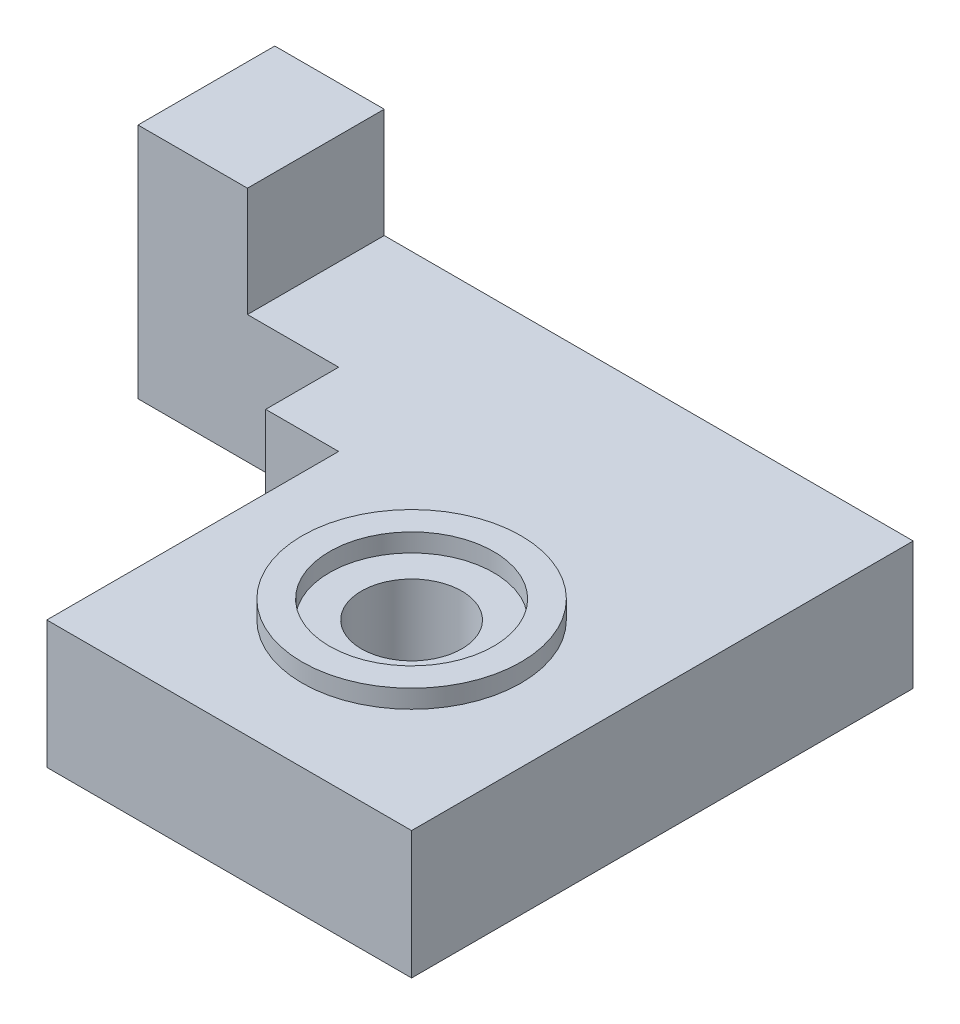
ISO-10303-21;
HEADER;
FILE_DESCRIPTION(('STEP AP214'),'2;1');
FILE_NAME('part.step','',(''),(''),'','','');
FILE_SCHEMA(('AUTOMOTIVE_DESIGN { 1 0 10303 214 1 1 1 1 }'));
ENDSEC;
DATA;
#1=APPLICATION_CONTEXT('core data for automotive mechanical design processes');
#2=APPLICATION_PROTOCOL_DEFINITION('international standard','automotive_design',2000,#1);
#3=PRODUCT_CONTEXT('',#1,'mechanical');
#4=PRODUCT('Part','Part','',(#3));
#5=PRODUCT_RELATED_PRODUCT_CATEGORY('part','',(#4));
#6=PRODUCT_DEFINITION_FORMATION('','',#4);
#7=PRODUCT_DEFINITION_CONTEXT('part definition',#1,'design');
#8=PRODUCT_DEFINITION('design','',#6,#7);
#9=PRODUCT_DEFINITION_SHAPE('','',#8);
#10=(LENGTH_UNIT() NAMED_UNIT(*) SI_UNIT(.MILLI.,.METRE.));
#11=(NAMED_UNIT(*) PLANE_ANGLE_UNIT() SI_UNIT($,.RADIAN.));
#12=(NAMED_UNIT(*) SI_UNIT($,.STERADIAN.) SOLID_ANGLE_UNIT());
#13=UNCERTAINTY_MEASURE_WITH_UNIT(LENGTH_MEASURE(1.E-05),#10,'distance_accuracy_value','');
#14=(GEOMETRIC_REPRESENTATION_CONTEXT(3) GLOBAL_UNCERTAINTY_ASSIGNED_CONTEXT((#13)) GLOBAL_UNIT_ASSIGNED_CONTEXT((#10,
#11,#12)) REPRESENTATION_CONTEXT('',''));
#15=CARTESIAN_POINT('',(0.,0.,0.));
#16=DIRECTION('',(0.,0.,1.));
#17=DIRECTION('',(1.,0.,0.));
#18=AXIS2_PLACEMENT_3D('',#15,#16,#17);
#19=CARTESIAN_POINT('',(0.,7.,-20.));
#20=DIRECTION('',(0.,0.,1.));
#21=DIRECTION('',(1.,0.,0.));
#22=AXIS2_PLACEMENT_3D('',#19,#20,#21);
#23=PLANE('',#22);
#24=DIRECTION('',(-1.,0.,0.));
#25=VECTOR('',#24,1.);
#26=CARTESIAN_POINT('',(0.,0.,-20.));
#27=LINE('',#26,#25);
#28=CARTESIAN_POINT('',(-4.,0.,-20.));
#29=VERTEX_POINT('',#28);
#30=CARTESIAN_POINT('',(-15.,0.,-20.));
#31=VERTEX_POINT('',#30);
#32=EDGE_CURVE('E259',#29,#31,#27,.T.);
#33=ORIENTED_EDGE('',*,*,#32,.F.);
#34=DIRECTION('',(0.,-1.,0.));
#35=VECTOR('',#34,1.);
#36=CARTESIAN_POINT('',(-4.,7.,-20.));
#37=LINE('',#36,#35);
#38=CARTESIAN_POINT('',(-4.,7.,-20.));
#39=VERTEX_POINT('',#38);
#40=EDGE_CURVE('E173',#39,#29,#37,.T.);
#41=ORIENTED_EDGE('',*,*,#40,.F.);
#42=DIRECTION('',(-1.,0.,0.));
#43=VECTOR('',#42,1.);
#44=CARTESIAN_POINT('',(0.,7.,-20.));
#45=LINE('',#44,#43);
#46=CARTESIAN_POINT('',(-9.,7.,-20.));
#47=VERTEX_POINT('',#46);
#48=EDGE_CURVE('E237',#39,#47,#45,.T.);
#49=ORIENTED_EDGE('',*,*,#48,.T.);
#50=DIRECTION('',(0.,-1.,0.));
#51=VECTOR('',#50,1.);
#52=CARTESIAN_POINT('',(-9.,13.,-20.));
#53=LINE('',#52,#51);
#54=CARTESIAN_POINT('',(-9.,13.,-20.));
#55=VERTEX_POINT('',#54);
#56=EDGE_CURVE('E229',#55,#47,#53,.T.);
#57=ORIENTED_EDGE('',*,*,#56,.F.);
#58=DIRECTION('',(1.,0.,0.));
#59=VECTOR('',#58,1.);
#60=CARTESIAN_POINT('',(-15.,13.,-20.));
#61=LINE('',#60,#59);
#62=CARTESIAN_POINT('',(-15.,13.,-20.));
#63=VERTEX_POINT('',#62);
#64=EDGE_CURVE('E212',#63,#55,#61,.T.);
#65=ORIENTED_EDGE('',*,*,#64,.F.);
#66=DIRECTION('',(0.,-1.,0.));
#67=VECTOR('',#66,1.);
#68=CARTESIAN_POINT('',(-15.,7.,-20.));
#69=LINE('',#68,#67);
#70=EDGE_CURVE('E283',#63,#31,#69,.T.);
#71=ORIENTED_EDGE('',*,*,#70,.T.);
#72=EDGE_LOOP('',(#33,#41,#49,#57,#65,#71));
#73=FACE_BOUND('',#72,.T.);
#74=ADVANCED_FACE('F40',(#73),#23,.T.);
#75=CARTESIAN_POINT('',(0.,7.,-27.5));
#76=DIRECTION('',(0.,0.,1.));
#77=DIRECTION('',(1.,0.,0.));
#78=AXIS2_PLACEMENT_3D('',#75,#76,#77);
#79=PLANE('',#78);
#80=DIRECTION('',(-1.,0.,0.));
#81=VECTOR('',#80,1.);
#82=CARTESIAN_POINT('',(0.,0.,-27.5));
#83=LINE('',#82,#81);
#84=CARTESIAN_POINT('',(20.,0.,-27.5));
#85=VERTEX_POINT('',#84);
#86=CARTESIAN_POINT('',(-15.,0.,-27.5));
#87=VERTEX_POINT('',#86);
#88=EDGE_CURVE('E233',#85,#87,#83,.T.);
#89=ORIENTED_EDGE('',*,*,#88,.T.);
#90=DIRECTION('',(0.,-1.,0.));
#91=VECTOR('',#90,1.);
#92=CARTESIAN_POINT('',(-15.,7.,-27.5));
#93=LINE('',#92,#91);
#94=CARTESIAN_POINT('',(-15.,13.,-27.5));
#95=VERTEX_POINT('',#94);
#96=EDGE_CURVE('E287',#95,#87,#93,.T.);
#97=ORIENTED_EDGE('',*,*,#96,.F.);
#98=DIRECTION('',(-1.,0.,0.));
#99=VECTOR('',#98,1.);
#100=CARTESIAN_POINT('',(-15.,13.,-27.5));
#101=LINE('',#100,#99);
#102=CARTESIAN_POINT('',(-9.,13.,-27.5));
#103=VERTEX_POINT('',#102);
#104=EDGE_CURVE('E218',#103,#95,#101,.T.);
#105=ORIENTED_EDGE('',*,*,#104,.F.);
#106=DIRECTION('',(0.,-1.,0.));
#107=VECTOR('',#106,1.);
#108=CARTESIAN_POINT('',(-9.,13.,-27.5));
#109=LINE('',#108,#107);
#110=CARTESIAN_POINT('',(-9.,7.,-27.5));
#111=VERTEX_POINT('',#110);
#112=EDGE_CURVE('E222',#103,#111,#109,.T.);
#113=ORIENTED_EDGE('',*,*,#112,.T.);
#114=DIRECTION('',(-1.,0.,0.));
#115=VECTOR('',#114,1.);
#116=CARTESIAN_POINT('',(0.,7.,-27.5));
#117=LINE('',#116,#115);
#118=CARTESIAN_POINT('',(20.,7.,-27.5));
#119=VERTEX_POINT('',#118);
#120=EDGE_CURVE('E234',#119,#111,#117,.T.);
#121=ORIENTED_EDGE('',*,*,#120,.F.);
#122=DIRECTION('',(0.,-1.,0.));
#123=VECTOR('',#122,1.);
#124=CARTESIAN_POINT('',(20.,7.,-27.5));
#125=LINE('',#124,#123);
#126=EDGE_CURVE('E251',#119,#85,#125,.T.);
#127=ORIENTED_EDGE('',*,*,#126,.T.);
#128=EDGE_LOOP('',(#89,#97,#105,#113,#121,#127));
#129=FACE_BOUND('',#128,.T.);
#130=ADVANCED_FACE('F316',(#129),#79,.F.);
#131=CARTESIAN_POINT('',(-15.,7.,0.));
#132=DIRECTION('',(1.,0.,0.));
#133=DIRECTION('',(0.,0.,-1.));
#134=AXIS2_PLACEMENT_3D('',#131,#132,#133);
#135=PLANE('',#134);
#136=CARTESIAN_POINT('',(-15.,9.75,-25.5));
#137=DIRECTION('',(-1.,0.,0.));
#138=DIRECTION('',(0.,0.,1.));
#139=AXIS2_PLACEMENT_3D('',#136,#137,#138);
#140=CIRCLE('',#139,1.);
#141=CARTESIAN_POINT('',(-15.,9.75,-24.5));
#142=VERTEX_POINT('',#141);
#143=EDGE_CURVE('E189',#142,#142,#140,.T.);
#144=ORIENTED_EDGE('',*,*,#143,.F.);
#145=EDGE_LOOP('',(#144));
#146=FACE_BOUND('',#145,.T.);
#147=CARTESIAN_POINT('',(-15.,3.25,-25.5));
#148=DIRECTION('',(-1.,0.,0.));
#149=DIRECTION('',(0.,0.,1.));
#150=AXIS2_PLACEMENT_3D('',#147,#148,#149);
#151=CIRCLE('',#150,1.);
#152=CARTESIAN_POINT('',(-15.,3.25,-24.5));
#153=VERTEX_POINT('',#152);
#154=EDGE_CURVE('E159',#153,#153,#151,.T.);
#155=ORIENTED_EDGE('',*,*,#154,.F.);
#156=EDGE_LOOP('',(#155));
#157=FACE_BOUND('',#156,.T.);
#158=DIRECTION('',(0.,0.,1.));
#159=VECTOR('',#158,1.);
#160=CARTESIAN_POINT('',(-15.,0.,0.));
#161=LINE('',#160,#159);
#162=EDGE_CURVE('E255',#87,#31,#161,.T.);
#163=ORIENTED_EDGE('',*,*,#162,.T.);
#164=ORIENTED_EDGE('',*,*,#70,.F.);
#165=DIRECTION('',(0.,0.,1.));
#166=VECTOR('',#165,1.);
#167=CARTESIAN_POINT('',(-15.,13.,-27.5));
#168=LINE('',#167,#166);
#169=EDGE_CURVE('E208',#95,#63,#168,.T.);
#170=ORIENTED_EDGE('',*,*,#169,.F.);
#171=ORIENTED_EDGE('',*,*,#96,.T.);
#172=EDGE_LOOP('',(#163,#164,#170,#171));
#173=FACE_BOUND('',#172,.T.);
#174=ADVANCED_FACE('F313',(#146,#157,#173),#135,.F.);
#175=CARTESIAN_POINT('',(0.,7.,0.));
#176=DIRECTION('',(-1.,0.,0.));
#177=DIRECTION('',(0.,0.,1.));
#178=AXIS2_PLACEMENT_3D('',#175,#176,#177);
#179=PLANE('',#178);
#180=DIRECTION('',(0.,1.,0.));
#181=VECTOR('',#180,1.);
#182=CARTESIAN_POINT('',(0.,7.,-16.));
#183=LINE('',#182,#181);
#184=CARTESIAN_POINT('',(0.,0.,-16.));
#185=VERTEX_POINT('',#184);
#186=CARTESIAN_POINT('',(0.,7.,-16.));
#187=VERTEX_POINT('',#186);
#188=EDGE_CURVE('E148',#185,#187,#183,.T.);
#189=ORIENTED_EDGE('',*,*,#188,.F.);
#190=DIRECTION('',(0.,0.,-1.));
#191=VECTOR('',#190,1.);
#192=CARTESIAN_POINT('',(0.,0.,0.));
#193=LINE('',#192,#191);
#194=CARTESIAN_POINT('',(0.,0.,0.));
#195=VERTEX_POINT('',#194);
#196=EDGE_CURVE('E264',#195,#185,#193,.T.);
#197=ORIENTED_EDGE('',*,*,#196,.F.);
#198=DIRECTION('',(0.,-1.,0.));
#199=VECTOR('',#198,1.);
#200=CARTESIAN_POINT('',(0.,7.,0.));
#201=LINE('',#200,#199);
#202=CARTESIAN_POINT('',(0.,7.,0.));
#203=VERTEX_POINT('',#202);
#204=EDGE_CURVE('E280',#203,#195,#201,.T.);
#205=ORIENTED_EDGE('',*,*,#204,.F.);
#206=DIRECTION('',(0.,0.,-1.));
#207=VECTOR('',#206,1.);
#208=CARTESIAN_POINT('',(0.,7.,0.));
#209=LINE('',#208,#207);
#210=EDGE_CURVE('E241',#203,#187,#209,.T.);
#211=ORIENTED_EDGE('',*,*,#210,.T.);
#212=EDGE_LOOP('',(#189,#197,#205,#211));
#213=FACE_BOUND('',#212,.T.);
#214=ADVANCED_FACE('F331',(#213),#179,.T.);
#215=CARTESIAN_POINT('',(0.,7.,0.));
#216=DIRECTION('',(0.,0.,-1.));
#217=DIRECTION('',(-1.,0.,0.));
#218=AXIS2_PLACEMENT_3D('',#215,#216,#217);
#219=PLANE('',#218);
#220=DIRECTION('',(1.,0.,0.));
#221=VECTOR('',#220,1.);
#222=CARTESIAN_POINT('',(0.,0.,0.));
#223=LINE('',#222,#221);
#224=CARTESIAN_POINT('',(20.,0.,0.));
#225=VERTEX_POINT('',#224);
#226=EDGE_CURVE('E268',#195,#225,#223,.T.);
#227=ORIENTED_EDGE('',*,*,#226,.T.);
#228=DIRECTION('',(0.,-1.,0.));
#229=VECTOR('',#228,1.);
#230=CARTESIAN_POINT('',(20.,7.,0.));
#231=LINE('',#230,#229);
#232=CARTESIAN_POINT('',(20.,7.,0.));
#233=VERTEX_POINT('',#232);
#234=EDGE_CURVE('E276',#233,#225,#231,.T.);
#235=ORIENTED_EDGE('',*,*,#234,.F.);
#236=DIRECTION('',(1.,0.,0.));
#237=VECTOR('',#236,1.);
#238=CARTESIAN_POINT('',(0.,7.,0.));
#239=LINE('',#238,#237);
#240=EDGE_CURVE('E245',#203,#233,#239,.T.);
#241=ORIENTED_EDGE('',*,*,#240,.F.);
#242=ORIENTED_EDGE('',*,*,#204,.T.);
#243=EDGE_LOOP('',(#227,#235,#241,#242));
#244=FACE_BOUND('',#243,.T.);
#245=ADVANCED_FACE('F328',(#244),#219,.F.);
#246=CARTESIAN_POINT('',(20.,7.,0.));
#247=DIRECTION('',(-1.,0.,0.));
#248=DIRECTION('',(0.,0.,1.));
#249=AXIS2_PLACEMENT_3D('',#246,#247,#248);
#250=PLANE('',#249);
#251=DIRECTION('',(0.,0.,-1.));
#252=VECTOR('',#251,1.);
#253=CARTESIAN_POINT('',(20.,0.,0.));
#254=LINE('',#253,#252);
#255=EDGE_CURVE('E238',#225,#85,#254,.T.);
#256=ORIENTED_EDGE('',*,*,#255,.T.);
#257=ORIENTED_EDGE('',*,*,#126,.F.);
#258=DIRECTION('',(0.,0.,-1.));
#259=VECTOR('',#258,1.);
#260=CARTESIAN_POINT('',(20.,7.,0.));
#261=LINE('',#260,#259);
#262=EDGE_CURVE('E248',#233,#119,#261,.T.);
#263=ORIENTED_EDGE('',*,*,#262,.F.);
#264=ORIENTED_EDGE('',*,*,#234,.T.);
#265=EDGE_LOOP('',(#256,#257,#263,#264));
#266=FACE_BOUND('',#265,.T.);
#267=ADVANCED_FACE('F323',(#266),#250,.F.);
#268=CARTESIAN_POINT('',(0.,7.,0.));
#269=DIRECTION('',(0.,1.,0.));
#270=DIRECTION('',(0.,0.,1.));
#271=AXIS2_PLACEMENT_3D('',#268,#269,#270);
#272=PLANE('',#271);
#273=CARTESIAN_POINT('',(10.,7.,-10.));
#274=DIRECTION('',(0.,1.,0.));
#275=DIRECTION('',(0.,0.,1.));
#276=AXIS2_PLACEMENT_3D('',#273,#274,#275);
#277=CIRCLE('',#276,6.);
#278=CARTESIAN_POINT('',(10.,7.,-4.00000000000003));
#279=VERTEX_POINT('',#278);
#280=EDGE_CURVE('E188',#279,#279,#277,.T.);
#281=ORIENTED_EDGE('',*,*,#280,.F.);
#282=EDGE_LOOP('',(#281));
#283=FACE_BOUND('',#282,.T.);
#284=DIRECTION('',(0.,0.,-1.));
#285=VECTOR('',#284,1.);
#286=CARTESIAN_POINT('',(-9.,7.,-27.5));
#287=LINE('',#286,#285);
#288=EDGE_CURVE('E204',#47,#111,#287,.T.);
#289=ORIENTED_EDGE('',*,*,#288,.F.);
#290=ORIENTED_EDGE('',*,*,#48,.F.);
#291=DIRECTION('',(0.,0.,-1.));
#292=VECTOR('',#291,1.);
#293=CARTESIAN_POINT('',(-4.,7.,-16.));
#294=LINE('',#293,#292);
#295=CARTESIAN_POINT('',(-4.,7.,-16.));
#296=VERTEX_POINT('',#295);
#297=EDGE_CURVE('E160',#296,#39,#294,.T.);
#298=ORIENTED_EDGE('',*,*,#297,.F.);
#299=DIRECTION('',(-1.,0.,0.));
#300=VECTOR('',#299,1.);
#301=CARTESIAN_POINT('',(-4.,7.,-16.));
#302=LINE('',#301,#300);
#303=EDGE_CURVE('E166',#187,#296,#302,.T.);
#304=ORIENTED_EDGE('',*,*,#303,.F.);
#305=ORIENTED_EDGE('',*,*,#210,.F.);
#306=ORIENTED_EDGE('',*,*,#240,.T.);
#307=ORIENTED_EDGE('',*,*,#262,.T.);
#308=ORIENTED_EDGE('',*,*,#120,.T.);
#309=EDGE_LOOP('',(#289,#290,#298,#304,#305,#306,#307,#308));
#310=FACE_BOUND('',#309,.T.);
#311=ADVANCED_FACE('F336',(#283,#310),#272,.T.);
#312=CARTESIAN_POINT('',(0.,0.,0.));
#313=DIRECTION('',(0.,1.,0.));
#314=DIRECTION('',(0.,0.,1.));
#315=AXIS2_PLACEMENT_3D('',#312,#313,#314);
#316=PLANE('',#315);
#317=CARTESIAN_POINT('',(10.,0.,-10.));
#318=DIRECTION('',(0.,1.,0.));
#319=DIRECTION('',(0.,0.,1.));
#320=AXIS2_PLACEMENT_3D('',#317,#318,#319);
#321=CIRCLE('',#320,2.75);
#322=CARTESIAN_POINT('',(10.,0.,-7.25000000000003));
#323=VERTEX_POINT('',#322);
#324=EDGE_CURVE('E292',#323,#323,#321,.T.);
#325=ORIENTED_EDGE('',*,*,#324,.T.);
#326=EDGE_LOOP('',(#325));
#327=FACE_BOUND('',#326,.T.);
#328=ORIENTED_EDGE('',*,*,#88,.F.);
#329=ORIENTED_EDGE('',*,*,#255,.F.);
#330=ORIENTED_EDGE('',*,*,#226,.F.);
#331=ORIENTED_EDGE('',*,*,#196,.T.);
#332=CARTESIAN_POINT('',(0.,0.,-20.));
#333=VERTEX_POINT('',#332);
#334=EDGE_CURVE('E164',#185,#333,#193,.T.);
#335=ORIENTED_EDGE('',*,*,#334,.T.);
#336=EDGE_CURVE('E260',#333,#29,#27,.T.);
#337=ORIENTED_EDGE('',*,*,#336,.T.);
#338=ORIENTED_EDGE('',*,*,#32,.T.);
#339=ORIENTED_EDGE('',*,*,#162,.F.);
#340=EDGE_LOOP('',(#328,#329,#330,#331,#335,#337,#338,#339));
#341=FACE_BOUND('',#340,.T.);
#342=ADVANCED_FACE('F306',(#327,#341),#316,.F.);
#343=CARTESIAN_POINT('',(-9.,13.,-27.5));
#344=DIRECTION('',(-1.,0.,0.));
#345=DIRECTION('',(0.,0.,1.));
#346=AXIS2_PLACEMENT_3D('',#343,#344,#345);
#347=PLANE('',#346);
#348=ORIENTED_EDGE('',*,*,#288,.T.);
#349=ORIENTED_EDGE('',*,*,#112,.F.);
#350=DIRECTION('',(0.,0.,-1.));
#351=VECTOR('',#350,1.);
#352=CARTESIAN_POINT('',(-9.,13.,-27.5));
#353=LINE('',#352,#351);
#354=EDGE_CURVE('E215',#55,#103,#353,.T.);
#355=ORIENTED_EDGE('',*,*,#354,.F.);
#356=ORIENTED_EDGE('',*,*,#56,.T.);
#357=EDGE_LOOP('',(#348,#349,#355,#356));
#358=FACE_BOUND('',#357,.T.);
#359=ADVANCED_FACE('F375',(#358),#347,.F.);
#360=CARTESIAN_POINT('',(0.,13.,0.));
#361=DIRECTION('',(0.,1.,0.));
#362=DIRECTION('',(0.,0.,1.));
#363=AXIS2_PLACEMENT_3D('',#360,#361,#362);
#364=PLANE('',#363);
#365=ORIENTED_EDGE('',*,*,#169,.T.);
#366=ORIENTED_EDGE('',*,*,#64,.T.);
#367=ORIENTED_EDGE('',*,*,#354,.T.);
#368=ORIENTED_EDGE('',*,*,#104,.T.);
#369=EDGE_LOOP('',(#365,#366,#367,#368));
#370=FACE_BOUND('',#369,.T.);
#371=ADVANCED_FACE('F365',(#370),#364,.T.);
#372=CARTESIAN_POINT('',(10.,8.,-10.));
#373=DIRECTION('',(0.,-1.,0.));
#374=DIRECTION('',(0.,0.,-1.));
#375=AXIS2_PLACEMENT_3D('',#372,#373,#374);
#376=CYLINDRICAL_SURFACE('',#375,6.);
#377=CARTESIAN_POINT('',(10.,8.,-10.));
#378=DIRECTION('',(0.,1.,0.));
#379=DIRECTION('',(0.,0.,1.));
#380=AXIS2_PLACEMENT_3D('',#377,#378,#379);
#381=CIRCLE('',#380,6.);
#382=CARTESIAN_POINT('',(10.,8.,-4.00000000000003));
#383=VERTEX_POINT('',#382);
#384=EDGE_CURVE('E200',#383,#383,#381,.T.);
#385=ORIENTED_EDGE('',*,*,#384,.F.);
#386=EDGE_LOOP('',(#385));
#387=FACE_BOUND('',#386,.T.);
#388=ORIENTED_EDGE('',*,*,#280,.T.);
#389=EDGE_LOOP('',(#388));
#390=FACE_BOUND('',#389,.T.);
#391=ADVANCED_FACE('F359',(#387,#390),#376,.T.);
#392=CARTESIAN_POINT('',(10.,8.,-10.));
#393=DIRECTION('',(0.,1.,0.));
#394=DIRECTION('',(0.,0.,1.));
#395=AXIS2_PLACEMENT_3D('',#392,#393,#394);
#396=PLANE('',#395);
#397=CARTESIAN_POINT('',(10.,8.,-10.));
#398=DIRECTION('',(0.,1.,0.));
#399=DIRECTION('',(0.,0.,1.));
#400=AXIS2_PLACEMENT_3D('',#397,#398,#399);
#401=CIRCLE('',#400,4.49999999999999);
#402=CARTESIAN_POINT('',(10.,8.,-5.50000000000004));
#403=VERTEX_POINT('',#402);
#404=EDGE_CURVE('E348',#403,#403,#401,.T.);
#405=ORIENTED_EDGE('',*,*,#404,.F.);
#406=EDGE_LOOP('',(#405));
#407=FACE_BOUND('',#406,.T.);
#408=ORIENTED_EDGE('',*,*,#384,.T.);
#409=EDGE_LOOP('',(#408));
#410=FACE_BOUND('',#409,.T.);
#411=ADVANCED_FACE('F355',(#407,#410),#396,.T.);
#412=CARTESIAN_POINT('',(-11.,3.25,-25.5));
#413=DIRECTION('',(-1.,0.,0.));
#414=DIRECTION('',(0.,0.,1.));
#415=AXIS2_PLACEMENT_3D('',#412,#413,#414);
#416=CYLINDRICAL_SURFACE('',#415,1.);
#417=CARTESIAN_POINT('',(-11.,3.25,-25.5));
#418=DIRECTION('',(-1.,0.,0.));
#419=DIRECTION('',(0.,0.,1.));
#420=AXIS2_PLACEMENT_3D('',#417,#418,#419);
#421=CIRCLE('',#420,1.);
#422=CARTESIAN_POINT('',(-11.,3.25,-24.5));
#423=VERTEX_POINT('',#422);
#424=EDGE_CURVE('E193',#423,#423,#421,.T.);
#425=ORIENTED_EDGE('',*,*,#424,.F.);
#426=EDGE_LOOP('',(#425));
#427=FACE_BOUND('',#426,.T.);
#428=ORIENTED_EDGE('',*,*,#154,.T.);
#429=EDGE_LOOP('',(#428));
#430=FACE_BOUND('',#429,.T.);
#431=ADVANCED_FACE('F358',(#427,#430),#416,.F.);
#432=CARTESIAN_POINT('',(-11.,3.25,-25.5));
#433=DIRECTION('',(-1.,0.,0.));
#434=DIRECTION('',(0.,0.,1.));
#435=AXIS2_PLACEMENT_3D('',#432,#433,#434);
#436=PLANE('',#435);
#437=ORIENTED_EDGE('',*,*,#424,.T.);
#438=EDGE_LOOP('',(#437));
#439=FACE_BOUND('',#438,.T.);
#440=ADVANCED_FACE('F398',(#439),#436,.T.);
#441=CARTESIAN_POINT('',(-11.,9.75,-25.5));
#442=DIRECTION('',(-1.,0.,0.));
#443=DIRECTION('',(0.,0.,1.));
#444=AXIS2_PLACEMENT_3D('',#441,#442,#443);
#445=CYLINDRICAL_SURFACE('',#444,1.);
#446=CARTESIAN_POINT('',(-11.,9.75,-25.5));
#447=DIRECTION('',(-1.,0.,0.));
#448=DIRECTION('',(0.,0.,1.));
#449=AXIS2_PLACEMENT_3D('',#446,#447,#448);
#450=CIRCLE('',#449,1.);
#451=CARTESIAN_POINT('',(-11.,9.75,-24.5));
#452=VERTEX_POINT('',#451);
#453=EDGE_CURVE('E184',#452,#452,#450,.T.);
#454=ORIENTED_EDGE('',*,*,#453,.F.);
#455=EDGE_LOOP('',(#454));
#456=FACE_BOUND('',#455,.T.);
#457=ORIENTED_EDGE('',*,*,#143,.T.);
#458=EDGE_LOOP('',(#457));
#459=FACE_BOUND('',#458,.T.);
#460=ADVANCED_FACE('F404',(#456,#459),#445,.F.);
#461=CARTESIAN_POINT('',(-11.,9.75,-25.5));
#462=DIRECTION('',(-1.,0.,0.));
#463=DIRECTION('',(0.,0.,1.));
#464=AXIS2_PLACEMENT_3D('',#461,#462,#463);
#465=PLANE('',#464);
#466=ORIENTED_EDGE('',*,*,#453,.T.);
#467=EDGE_LOOP('',(#466));
#468=FACE_BOUND('',#467,.T.);
#469=ADVANCED_FACE('F428',(#468),#465,.T.);
#470=CARTESIAN_POINT('',(0.,7.,-16.));
#471=DIRECTION('',(-1.,0.,0.));
#472=DIRECTION('',(0.,-1.,0.));
#473=AXIS2_PLACEMENT_3D('',#470,#471,#472);
#474=PLANE('',#473);
#475=DIRECTION('',(0.,1.,0.));
#476=VECTOR('',#475,1.);
#477=CARTESIAN_POINT('',(0.,7.,-20.));
#478=LINE('',#477,#476);
#479=CARTESIAN_POINT('',(0.,-4.,-20.));
#480=VERTEX_POINT('',#479);
#481=EDGE_CURVE('E179',#480,#333,#478,.T.);
#482=ORIENTED_EDGE('',*,*,#481,.T.);
#483=ORIENTED_EDGE('',*,*,#334,.F.);
#484=CARTESIAN_POINT('',(0.,-4.,-16.));
#485=VERTEX_POINT('',#484);
#486=EDGE_CURVE('E141',#485,#185,#183,.T.);
#487=ORIENTED_EDGE('',*,*,#486,.F.);
#488=DIRECTION('',(0.,0.,-1.));
#489=VECTOR('',#488,1.);
#490=CARTESIAN_POINT('',(0.,-4.,-16.));
#491=LINE('',#490,#489);
#492=EDGE_CURVE('E152',#485,#480,#491,.T.);
#493=ORIENTED_EDGE('',*,*,#492,.T.);
#494=EDGE_LOOP('',(#482,#483,#487,#493));
#495=FACE_BOUND('',#494,.T.);
#496=ADVANCED_FACE('F162',(#495),#474,.F.);
#497=CARTESIAN_POINT('',(0.,0.,-20.));
#498=DIRECTION('',(0.,0.,1.));
#499=DIRECTION('',(1.,0.,0.));
#500=AXIS2_PLACEMENT_3D('',#497,#498,#499);
#501=PLANE('',#500);
#502=DIRECTION('',(1.,0.,0.));
#503=VECTOR('',#502,1.);
#504=CARTESIAN_POINT('',(-4.,-4.,-20.));
#505=LINE('',#504,#503);
#506=CARTESIAN_POINT('',(-2.,-4.,-20.));
#507=VERTEX_POINT('',#506);
#508=EDGE_CURVE('E154',#507,#480,#505,.T.);
#509=ORIENTED_EDGE('',*,*,#508,.F.);
#510=DIRECTION('',(0.707106781186545,-0.70710678118655,0.));
#511=VECTOR('',#510,1.);
#512=CARTESIAN_POINT('',(-2.,-4.,-20.));
#513=LINE('',#512,#511);
#514=CARTESIAN_POINT('',(-4.,-1.99999999999999,-20.));
#515=VERTEX_POINT('',#514);
#516=EDGE_CURVE('E64',#507,#515,#513,.F.);
#517=ORIENTED_EDGE('',*,*,#516,.T.);
#518=EDGE_CURVE('E176',#29,#515,#37,.T.);
#519=ORIENTED_EDGE('',*,*,#518,.F.);
#520=ORIENTED_EDGE('',*,*,#336,.F.);
#521=ORIENTED_EDGE('',*,*,#481,.F.);
#522=EDGE_LOOP('',(#509,#517,#519,#520,#521));
#523=FACE_BOUND('',#522,.T.);
#524=ADVANCED_FACE('F418',(#523),#501,.F.);
#525=CARTESIAN_POINT('',(-4.,7.,-16.));
#526=DIRECTION('',(1.,0.,0.));
#527=DIRECTION('',(0.,1.,0.));
#528=AXIS2_PLACEMENT_3D('',#525,#526,#527);
#529=PLANE('',#528);
#530=ORIENTED_EDGE('',*,*,#518,.T.);
#531=DIRECTION('',(0.,0.,1.));
#532=VECTOR('',#531,1.);
#533=CARTESIAN_POINT('',(-4.,-1.99999999999999,-16.));
#534=LINE('',#533,#532);
#535=CARTESIAN_POINT('',(-4.,-1.99999999999999,-16.));
#536=VERTEX_POINT('',#535);
#537=EDGE_CURVE('E50',#515,#536,#534,.T.);
#538=ORIENTED_EDGE('',*,*,#537,.T.);
#539=DIRECTION('',(0.,-1.,0.));
#540=VECTOR('',#539,1.);
#541=CARTESIAN_POINT('',(-4.,7.,-16.));
#542=LINE('',#541,#540);
#543=EDGE_CURVE('E149',#296,#536,#542,.T.);
#544=ORIENTED_EDGE('',*,*,#543,.F.);
#545=ORIENTED_EDGE('',*,*,#297,.T.);
#546=ORIENTED_EDGE('',*,*,#40,.T.);
#547=EDGE_LOOP('',(#530,#538,#544,#545,#546));
#548=FACE_BOUND('',#547,.T.);
#549=ADVANCED_FACE('F338',(#548),#529,.F.);
#550=CARTESIAN_POINT('',(-4.,-4.,-16.));
#551=DIRECTION('',(0.,1.,0.));
#552=DIRECTION('',(0.,0.,1.));
#553=AXIS2_PLACEMENT_3D('',#550,#551,#552);
#554=PLANE('',#553);
#555=DIRECTION('',(1.,0.,0.));
#556=VECTOR('',#555,1.);
#557=CARTESIAN_POINT('',(-4.,-4.,-16.));
#558=LINE('',#557,#556);
#559=CARTESIAN_POINT('',(-2.,-4.,-16.));
#560=VERTEX_POINT('',#559);
#561=EDGE_CURVE('E137',#560,#485,#558,.T.);
#562=ORIENTED_EDGE('',*,*,#561,.F.);
#563=DIRECTION('',(0.,0.,-1.));
#564=VECTOR('',#563,1.);
#565=CARTESIAN_POINT('',(-2.,-4.,-16.));
#566=LINE('',#565,#564);
#567=EDGE_CURVE('E291',#560,#507,#566,.T.);
#568=ORIENTED_EDGE('',*,*,#567,.T.);
#569=ORIENTED_EDGE('',*,*,#508,.T.);
#570=ORIENTED_EDGE('',*,*,#492,.F.);
#571=EDGE_LOOP('',(#562,#568,#569,#570));
#572=FACE_BOUND('',#571,.T.);
#573=ADVANCED_FACE('F153',(#572),#554,.F.);
#574=CARTESIAN_POINT('',(0.,0.,-16.));
#575=DIRECTION('',(0.,0.,1.));
#576=DIRECTION('',(1.,0.,0.));
#577=AXIS2_PLACEMENT_3D('',#574,#575,#576);
#578=PLANE('',#577);
#579=ORIENTED_EDGE('',*,*,#543,.T.);
#580=DIRECTION('',(-0.707106781186545,0.70710678118655,0.));
#581=VECTOR('',#580,1.);
#582=CARTESIAN_POINT('',(-3.00000000000001,-2.99999999999999,-16.));
#583=LINE('',#582,#581);
#584=EDGE_CURVE('E11',#536,#560,#583,.F.);
#585=ORIENTED_EDGE('',*,*,#584,.T.);
#586=ORIENTED_EDGE('',*,*,#561,.T.);
#587=ORIENTED_EDGE('',*,*,#486,.T.);
#588=ORIENTED_EDGE('',*,*,#188,.T.);
#589=ORIENTED_EDGE('',*,*,#303,.T.);
#590=EDGE_LOOP('',(#579,#585,#586,#587,#588,#589));
#591=FACE_BOUND('',#590,.T.);
#592=ADVANCED_FACE('F139',(#591),#578,.T.);
#593=CARTESIAN_POINT('',(10.,8.,-10.));
#594=DIRECTION('',(0.,1.,0.));
#595=DIRECTION('',(0.,0.,1.));
#596=AXIS2_PLACEMENT_3D('',#593,#594,#595);
#597=CYLINDRICAL_SURFACE('',#596,2.75);
#598=CARTESIAN_POINT('',(10.,7.,-10.));
#599=DIRECTION('',(0.,1.,0.));
#600=DIRECTION('',(0.,0.,1.));
#601=AXIS2_PLACEMENT_3D('',#598,#599,#600);
#602=CIRCLE('',#601,2.75000000000001);
#603=CARTESIAN_POINT('',(10.,7.,-7.25000000000002));
#604=VERTEX_POINT('',#603);
#605=EDGE_CURVE('E296',#604,#604,#602,.T.);
#606=ORIENTED_EDGE('',*,*,#605,.T.);
#607=EDGE_LOOP('',(#606));
#608=FACE_BOUND('',#607,.T.);
#609=ORIENTED_EDGE('',*,*,#324,.F.);
#610=EDGE_LOOP('',(#609));
#611=FACE_BOUND('',#610,.T.);
#612=ADVANCED_FACE('F477',(#608,#611),#597,.F.);
#613=CARTESIAN_POINT('',(12.75,7.,-10.));
#614=DIRECTION('',(0.,-1.,0.));
#615=DIRECTION('',(0.,0.,-1.));
#616=AXIS2_PLACEMENT_3D('',#613,#614,#615);
#617=PLANE('',#616);
#618=ORIENTED_EDGE('',*,*,#605,.F.);
#619=EDGE_LOOP('',(#618));
#620=FACE_BOUND('',#619,.T.);
#621=CARTESIAN_POINT('',(10.,7.,-10.));
#622=DIRECTION('',(0.,1.,0.));
#623=DIRECTION('',(0.,0.,1.));
#624=AXIS2_PLACEMENT_3D('',#621,#622,#623);
#625=CIRCLE('',#624,4.49999999999999);
#626=CARTESIAN_POINT('',(10.,7.,-5.50000000000004));
#627=VERTEX_POINT('',#626);
#628=EDGE_CURVE('E344',#627,#627,#625,.T.);
#629=ORIENTED_EDGE('',*,*,#628,.T.);
#630=EDGE_LOOP('',(#629));
#631=FACE_BOUND('',#630,.T.);
#632=ADVANCED_FACE('F486',(#620,#631),#617,.F.);
#633=CARTESIAN_POINT('',(10.,8.,-10.));
#634=DIRECTION('',(0.,1.,0.));
#635=DIRECTION('',(0.,0.,1.));
#636=AXIS2_PLACEMENT_3D('',#633,#634,#635);
#637=CYLINDRICAL_SURFACE('',#636,4.49999999999999);
#638=ORIENTED_EDGE('',*,*,#628,.F.);
#639=EDGE_LOOP('',(#638));
#640=FACE_BOUND('',#639,.T.);
#641=ORIENTED_EDGE('',*,*,#404,.T.);
#642=EDGE_LOOP('',(#641));
#643=FACE_BOUND('',#642,.T.);
#644=ADVANCED_FACE('F353',(#640,#643),#637,.F.);
#645=CARTESIAN_POINT('',(-2.,-4.,-16.));
#646=DIRECTION('',(0.70710678118655,0.707106781186545,0.));
#647=DIRECTION('',(0.,0.,-1.));
#648=AXIS2_PLACEMENT_3D('',#645,#646,#647);
#649=PLANE('',#648);
#650=ORIENTED_EDGE('',*,*,#584,.F.);
#651=ORIENTED_EDGE('',*,*,#537,.F.);
#652=ORIENTED_EDGE('',*,*,#516,.F.);
#653=ORIENTED_EDGE('',*,*,#567,.F.);
#654=EDGE_LOOP('',(#650,#651,#652,#653));
#655=FACE_BOUND('',#654,.T.);
#656=ADVANCED_FACE('F43',(#655),#649,.F.);
#657=CLOSED_SHELL('',(#74,#130,#174,#214,#245,#267,#311,#342,#359,#371,#391,#411,#431,#440,#460,
#469,#496,#524,#549,#573,#592,#612,#632,#644,#656));
#658=MANIFOLD_SOLID_BREP('B2',#657);
#659=ADVANCED_BREP_SHAPE_REPRESENTATION('',(#18,#658),#14);
#660=SHAPE_DEFINITION_REPRESENTATION(#9,#659);
ENDSEC;
END-ISO-10303-21;
